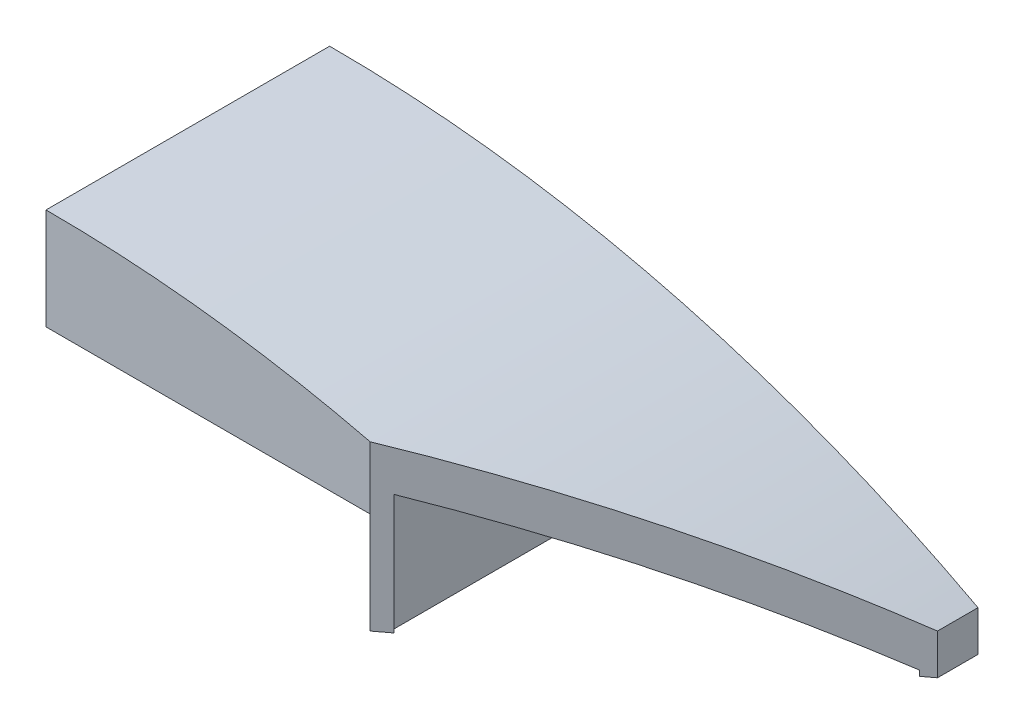
ISO-10303-21;
HEADER;
FILE_DESCRIPTION(('STEP AP214'),'2;1');
FILE_NAME('part.step','',(''),(''),'','','');
FILE_SCHEMA(('AUTOMOTIVE_DESIGN { 1 0 10303 214 1 1 1 1 }'));
ENDSEC;
DATA;
#1=APPLICATION_CONTEXT('core data for automotive mechanical design processes');
#2=APPLICATION_PROTOCOL_DEFINITION('international standard','automotive_design',2000,#1);
#3=PRODUCT_CONTEXT('',#1,'mechanical');
#4=PRODUCT('Part','Part','',(#3));
#5=PRODUCT_RELATED_PRODUCT_CATEGORY('part','',(#4));
#6=PRODUCT_DEFINITION_FORMATION('','',#4);
#7=PRODUCT_DEFINITION_CONTEXT('part definition',#1,'design');
#8=PRODUCT_DEFINITION('design','',#6,#7);
#9=PRODUCT_DEFINITION_SHAPE('','',#8);
#10=(LENGTH_UNIT() NAMED_UNIT(*) SI_UNIT(.MILLI.,.METRE.));
#11=(NAMED_UNIT(*) PLANE_ANGLE_UNIT() SI_UNIT($,.RADIAN.));
#12=(NAMED_UNIT(*) SI_UNIT($,.STERADIAN.) SOLID_ANGLE_UNIT());
#13=UNCERTAINTY_MEASURE_WITH_UNIT(LENGTH_MEASURE(1.E-05),#10,'distance_accuracy_value','');
#14=(GEOMETRIC_REPRESENTATION_CONTEXT(3) GLOBAL_UNCERTAINTY_ASSIGNED_CONTEXT((#13)) GLOBAL_UNIT_ASSIGNED_CONTEXT((#10,
#11,#12)) REPRESENTATION_CONTEXT('',''));
#15=CARTESIAN_POINT('',(0.,0.,0.));
#16=DIRECTION('',(0.,0.,1.));
#17=DIRECTION('',(1.,0.,0.));
#18=AXIS2_PLACEMENT_3D('',#15,#16,#17);
#19=CARTESIAN_POINT('',(-10.16,0.,4.445));
#20=DIRECTION('',(0.,1.,0.));
#21=DIRECTION('',(0.,0.,1.));
#22=AXIS2_PLACEMENT_3D('',#19,#20,#21);
#23=PLANE('',#22);
#24=DIRECTION('',(0.,0.,-1.));
#25=VECTOR('',#24,1.);
#26=CARTESIAN_POINT('',(0.,0.,4.445));
#27=LINE('',#26,#25);
#28=CARTESIAN_POINT('',(0.,0.,-4.1275));
#29=VERTEX_POINT('',#28);
#30=CARTESIAN_POINT('',(0.,0.,-4.445));
#31=VERTEX_POINT('',#30);
#32=EDGE_CURVE('E173',#29,#31,#27,.T.);
#33=ORIENTED_EDGE('',*,*,#32,.F.);
#34=DIRECTION('',(1.,0.,0.));
#35=VECTOR('',#34,1.);
#36=CARTESIAN_POINT('',(-9.8425,0.,-4.1275));
#37=LINE('',#36,#35);
#38=CARTESIAN_POINT('',(-9.8425,0.,-4.1275));
#39=VERTEX_POINT('',#38);
#40=EDGE_CURVE('E272',#39,#29,#37,.T.);
#41=ORIENTED_EDGE('',*,*,#40,.F.);
#42=DIRECTION('',(0.,0.,-1.));
#43=VECTOR('',#42,1.);
#44=CARTESIAN_POINT('',(-9.8425,0.,4.1275));
#45=LINE('',#44,#43);
#46=CARTESIAN_POINT('',(-9.8425,0.,4.1275));
#47=VERTEX_POINT('',#46);
#48=EDGE_CURVE('E269',#47,#39,#45,.T.);
#49=ORIENTED_EDGE('',*,*,#48,.F.);
#50=DIRECTION('',(-1.,0.,0.));
#51=VECTOR('',#50,1.);
#52=CARTESIAN_POINT('',(0.,0.,4.1275));
#53=LINE('',#52,#51);
#54=CARTESIAN_POINT('',(0.,0.,4.1275));
#55=VERTEX_POINT('',#54);
#56=EDGE_CURVE('E251',#55,#47,#53,.T.);
#57=ORIENTED_EDGE('',*,*,#56,.F.);
#58=CARTESIAN_POINT('',(0.,0.,4.445));
#59=VERTEX_POINT('',#58);
#60=EDGE_CURVE('E44',#59,#55,#27,.T.);
#61=ORIENTED_EDGE('',*,*,#60,.F.);
#62=DIRECTION('',(1.,0.,0.));
#63=VECTOR('',#62,1.);
#64=CARTESIAN_POINT('',(-10.16,0.,4.445));
#65=LINE('',#64,#63);
#66=CARTESIAN_POINT('',(-10.16,0.,4.445));
#67=VERTEX_POINT('',#66);
#68=EDGE_CURVE('E219',#67,#59,#65,.T.);
#69=ORIENTED_EDGE('',*,*,#68,.F.);
#70=DIRECTION('',(0.,0.,-1.));
#71=VECTOR('',#70,1.);
#72=CARTESIAN_POINT('',(-10.16,0.,4.445));
#73=LINE('',#72,#71);
#74=CARTESIAN_POINT('',(-10.16,0.,-4.445));
#75=VERTEX_POINT('',#74);
#76=EDGE_CURVE('E203',#67,#75,#73,.T.);
#77=ORIENTED_EDGE('',*,*,#76,.T.);
#78=DIRECTION('',(1.,0.,0.));
#79=VECTOR('',#78,1.);
#80=CARTESIAN_POINT('',(-10.16,0.,-4.445));
#81=LINE('',#80,#79);
#82=EDGE_CURVE('E198',#75,#31,#81,.T.);
#83=ORIENTED_EDGE('',*,*,#82,.T.);
#84=EDGE_LOOP('',(#33,#41,#49,#57,#61,#69,#77,#83));
#85=FACE_BOUND('',#84,.T.);
#86=ADVANCED_FACE('F37',(#85),#23,.F.);
#87=CARTESIAN_POINT('',(0.,0.,4.445));
#88=DIRECTION('',(1.,0.,0.));
#89=DIRECTION('',(0.,1.,0.));
#90=AXIS2_PLACEMENT_3D('',#87,#88,#89);
#91=PLANE('',#90);
#92=DIRECTION('',(0.,-1.,0.));
#93=VECTOR('',#92,1.);
#94=CARTESIAN_POINT('',(0.,0.,-4.445));
#95=LINE('',#94,#93);
#96=CARTESIAN_POINT('',(0.,-3.175,-4.445));
#97=VERTEX_POINT('',#96);
#98=EDGE_CURVE('E188',#31,#97,#95,.T.);
#99=ORIENTED_EDGE('',*,*,#98,.T.);
#100=DIRECTION('',(0.,0.,-1.));
#101=VECTOR('',#100,1.);
#102=CARTESIAN_POINT('',(0.,-3.175,4.445));
#103=LINE('',#102,#101);
#104=CARTESIAN_POINT('',(0.,-3.175,4.445));
#105=VERTEX_POINT('',#104);
#106=EDGE_CURVE('E171',#105,#97,#103,.T.);
#107=ORIENTED_EDGE('',*,*,#106,.F.);
#108=DIRECTION('',(0.,-1.,0.));
#109=VECTOR('',#108,1.);
#110=CARTESIAN_POINT('',(0.,0.,4.445));
#111=LINE('',#110,#109);
#112=EDGE_CURVE('E283',#59,#105,#111,.T.);
#113=ORIENTED_EDGE('',*,*,#112,.F.);
#114=ORIENTED_EDGE('',*,*,#60,.T.);
#115=DIRECTION('',(0.,-1.,0.));
#116=VECTOR('',#115,1.);
#117=CARTESIAN_POINT('',(0.,5.716,4.1275));
#118=LINE('',#117,#116);
#119=CARTESIAN_POINT('',(0.,0.654838907698595,4.1275));
#120=VERTEX_POINT('',#119);
#121=EDGE_CURVE('E274',#120,#55,#118,.T.);
#122=ORIENTED_EDGE('',*,*,#121,.F.);
#123=DIRECTION('',(0.,0.,-1.));
#124=VECTOR('',#123,1.);
#125=CARTESIAN_POINT('',(0.,0.654838907698595,4.445));
#126=LINE('',#125,#124);
#127=CARTESIAN_POINT('',(0.,0.654838907698595,-4.1275));
#128=VERTEX_POINT('',#127);
#129=EDGE_CURVE('E206',#120,#128,#126,.T.);
#130=ORIENTED_EDGE('',*,*,#129,.T.);
#131=DIRECTION('',(0.,-1.,0.));
#132=VECTOR('',#131,1.);
#133=CARTESIAN_POINT('',(0.,5.716,-4.1275));
#134=LINE('',#133,#132);
#135=EDGE_CURVE('E190',#128,#29,#134,.T.);
#136=ORIENTED_EDGE('',*,*,#135,.T.);
#137=ORIENTED_EDGE('',*,*,#32,.T.);
#138=EDGE_LOOP('',(#99,#107,#113,#114,#122,#130,#136,#137));
#139=FACE_BOUND('',#138,.T.);
#140=ADVANCED_FACE('F186',(#139),#91,.F.);
#141=CARTESIAN_POINT('',(0.,-3.175,4.445));
#142=DIRECTION('',(0.,1.,0.));
#143=DIRECTION('',(0.,0.,1.));
#144=AXIS2_PLACEMENT_3D('',#141,#142,#143);
#145=PLANE('',#144);
#146=DIRECTION('',(0.,0.,-1.));
#147=VECTOR('',#146,1.);
#148=CARTESIAN_POINT('',(10.16,-3.175,4.445));
#149=LINE('',#148,#147);
#150=CARTESIAN_POINT('',(10.16,-3.175,-3.175));
#151=VERTEX_POINT('',#150);
#152=CARTESIAN_POINT('',(10.16,-3.175,-4.445));
#153=VERTEX_POINT('',#152);
#154=EDGE_CURVE('E161',#151,#153,#149,.T.);
#155=ORIENTED_EDGE('',*,*,#154,.F.);
#156=DIRECTION('',(-0.8,0.,0.6));
#157=VECTOR('',#156,1.);
#158=CARTESIAN_POINT('',(10.16,-3.175,-3.175));
#159=LINE('',#158,#157);
#160=CARTESIAN_POINT('',(9.8425,-3.175,-2.936875));
#161=VERTEX_POINT('',#160);
#162=EDGE_CURVE('E144',#151,#161,#159,.T.);
#163=ORIENTED_EDGE('',*,*,#162,.T.);
#164=DIRECTION('',(0.,0.,1.));
#165=VECTOR('',#164,1.);
#166=CARTESIAN_POINT('',(9.8425,-3.175,4.1275));
#167=LINE('',#166,#165);
#168=CARTESIAN_POINT('',(9.8425,-3.175,-4.1275));
#169=VERTEX_POINT('',#168);
#170=EDGE_CURVE('E242',#169,#161,#167,.T.);
#171=ORIENTED_EDGE('',*,*,#170,.F.);
#172=DIRECTION('',(1.,0.,0.));
#173=VECTOR('',#172,1.);
#174=CARTESIAN_POINT('',(0.3175,-3.175,-4.1275));
#175=LINE('',#174,#173);
#176=CARTESIAN_POINT('',(0.3175,-3.175,-4.1275));
#177=VERTEX_POINT('',#176);
#178=EDGE_CURVE('E244',#177,#169,#175,.T.);
#179=ORIENTED_EDGE('',*,*,#178,.F.);
#180=DIRECTION('',(0.,0.,-1.));
#181=VECTOR('',#180,1.);
#182=CARTESIAN_POINT('',(0.3175,-3.175,4.1275));
#183=LINE('',#182,#181);
#184=CARTESIAN_POINT('',(0.3175,-3.175,4.1275));
#185=VERTEX_POINT('',#184);
#186=EDGE_CURVE('E58',#185,#177,#183,.T.);
#187=ORIENTED_EDGE('',*,*,#186,.F.);
#188=DIRECTION('',(-1.,0.,0.));
#189=VECTOR('',#188,1.);
#190=CARTESIAN_POINT('',(0.3175,-3.175,4.1275));
#191=LINE('',#190,#189);
#192=CARTESIAN_POINT('',(0.423333333333333,-3.175,4.1275));
#193=VERTEX_POINT('',#192);
#194=EDGE_CURVE('E239',#193,#185,#191,.T.);
#195=ORIENTED_EDGE('',*,*,#194,.F.);
#196=EDGE_CURVE('E155',#193,#105,#159,.T.);
#197=ORIENTED_EDGE('',*,*,#196,.T.);
#198=ORIENTED_EDGE('',*,*,#106,.T.);
#199=DIRECTION('',(1.,0.,0.));
#200=VECTOR('',#199,1.);
#201=CARTESIAN_POINT('',(0.,-3.175,-4.445));
#202=LINE('',#201,#200);
#203=EDGE_CURVE('E169',#97,#153,#202,.T.);
#204=ORIENTED_EDGE('',*,*,#203,.T.);
#205=EDGE_LOOP('',(#155,#163,#171,#179,#187,#195,#197,#198,#204));
#206=FACE_BOUND('',#205,.T.);
#207=ADVANCED_FACE('F166',(#206),#145,.F.);
#208=CARTESIAN_POINT('',(10.16,-3.175,4.445));
#209=DIRECTION('',(-1.,0.,0.));
#210=DIRECTION('',(0.,0.,1.));
#211=AXIS2_PLACEMENT_3D('',#208,#209,#210);
#212=PLANE('',#211);
#213=DIRECTION('',(0.,0.,-1.));
#214=VECTOR('',#213,1.);
#215=CARTESIAN_POINT('',(10.16,-1.905,4.445));
#216=LINE('',#215,#214);
#217=CARTESIAN_POINT('',(10.16,-1.905,-3.175));
#218=VERTEX_POINT('',#217);
#219=CARTESIAN_POINT('',(10.16,-1.905,-4.445));
#220=VERTEX_POINT('',#219);
#221=EDGE_CURVE('E163',#218,#220,#216,.T.);
#222=ORIENTED_EDGE('',*,*,#221,.F.);
#223=DIRECTION('',(0.,1.,0.));
#224=VECTOR('',#223,1.);
#225=CARTESIAN_POINT('',(10.16,-3.175,-3.175));
#226=LINE('',#225,#224);
#227=EDGE_CURVE('E147',#151,#218,#226,.T.);
#228=ORIENTED_EDGE('',*,*,#227,.F.);
#229=ORIENTED_EDGE('',*,*,#154,.T.);
#230=DIRECTION('',(0.,1.,0.));
#231=VECTOR('',#230,1.);
#232=CARTESIAN_POINT('',(10.16,-3.175,-4.445));
#233=LINE('',#232,#231);
#234=EDGE_CURVE('E213',#153,#220,#233,.T.);
#235=ORIENTED_EDGE('',*,*,#234,.T.);
#236=EDGE_LOOP('',(#222,#228,#229,#235));
#237=FACE_BOUND('',#236,.T.);
#238=ADVANCED_FACE('F159',(#237),#212,.F.);
#239=CARTESIAN_POINT('',(-10.16,-40.005,4.445));
#240=DIRECTION('',(0.,0.,-1.));
#241=DIRECTION('',(-1.,0.,0.));
#242=AXIS2_PLACEMENT_3D('',#239,#240,#241);
#243=CYLINDRICAL_SURFACE('',#242,43.18);
#244=CARTESIAN_POINT('',(-10.16,-40.005,4.445));
#245=DIRECTION('',(0.,0.,1.));
#246=DIRECTION('',(-1.,0.,0.));
#247=AXIS2_PLACEMENT_3D('',#244,#245,#246);
#248=CIRCLE('',#247,43.18);
#249=CARTESIAN_POINT('',(0.,1.9626875703201,4.445));
#250=VERTEX_POINT('',#249);
#251=CARTESIAN_POINT('',(-10.16,3.175,4.445));
#252=VERTEX_POINT('',#251);
#253=EDGE_CURVE('E230',#250,#252,#248,.T.);
#254=ORIENTED_EDGE('',*,*,#253,.F.);
#255=CARTESIAN_POINT('',(-10.16,-40.005,12.065));
#256=DIRECTION('',(-0.6,0.,-0.8));
#257=DIRECTION('',(0.8,0.,-0.6));
#258=AXIS2_PLACEMENT_3D('',#255,#256,#257);
#259=ELLIPSE('',#258,53.975,43.18);
#260=EDGE_CURVE('E229',#250,#218,#259,.T.);
#261=ORIENTED_EDGE('',*,*,#260,.T.);
#262=ORIENTED_EDGE('',*,*,#221,.T.);
#263=CARTESIAN_POINT('',(-10.16,-40.005,-4.445));
#264=DIRECTION('',(0.,0.,1.));
#265=DIRECTION('',(-1.,0.,0.));
#266=AXIS2_PLACEMENT_3D('',#263,#264,#265);
#267=CIRCLE('',#266,43.18);
#268=CARTESIAN_POINT('',(-10.16,3.175,-4.445));
#269=VERTEX_POINT('',#268);
#270=EDGE_CURVE('E215',#220,#269,#267,.T.);
#271=ORIENTED_EDGE('',*,*,#270,.T.);
#272=DIRECTION('',(0.,0.,-1.));
#273=VECTOR('',#272,1.);
#274=CARTESIAN_POINT('',(-10.16,3.175,4.445));
#275=LINE('',#274,#273);
#276=EDGE_CURVE('E175',#252,#269,#275,.T.);
#277=ORIENTED_EDGE('',*,*,#276,.F.);
#278=EDGE_LOOP('',(#254,#261,#262,#271,#277));
#279=FACE_BOUND('',#278,.T.);
#280=ADVANCED_FACE('F228',(#279),#243,.T.);
#281=CARTESIAN_POINT('',(-10.16,0.,4.445));
#282=DIRECTION('',(1.,0.,0.));
#283=DIRECTION('',(0.,0.,-1.));
#284=AXIS2_PLACEMENT_3D('',#281,#282,#283);
#285=PLANE('',#284);
#286=DIRECTION('',(0.,-1.,0.));
#287=VECTOR('',#286,1.);
#288=CARTESIAN_POINT('',(-10.16,0.,-4.445));
#289=LINE('',#288,#287);
#290=EDGE_CURVE('E217',#269,#75,#289,.T.);
#291=ORIENTED_EDGE('',*,*,#290,.T.);
#292=ORIENTED_EDGE('',*,*,#76,.F.);
#293=DIRECTION('',(0.,-1.,0.));
#294=VECTOR('',#293,1.);
#295=CARTESIAN_POINT('',(-10.16,0.,4.445));
#296=LINE('',#295,#294);
#297=EDGE_CURVE('E209',#252,#67,#296,.T.);
#298=ORIENTED_EDGE('',*,*,#297,.F.);
#299=ORIENTED_EDGE('',*,*,#276,.T.);
#300=EDGE_LOOP('',(#291,#292,#298,#299));
#301=FACE_BOUND('',#300,.T.);
#302=ADVANCED_FACE('F224',(#301),#285,.F.);
#303=CARTESIAN_POINT('',(-10.16,-40.005,4.445));
#304=DIRECTION('',(0.,0.,-1.));
#305=DIRECTION('',(-1.,0.,0.));
#306=AXIS2_PLACEMENT_3D('',#303,#304,#305);
#307=PLANE('',#306);
#308=ORIENTED_EDGE('',*,*,#68,.T.);
#309=DIRECTION('',(0.,1.,0.));
#310=VECTOR('',#309,1.);
#311=CARTESIAN_POINT('',(0.,-3.175,4.445));
#312=LINE('',#311,#310);
#313=EDGE_CURVE('E164',#59,#250,#312,.T.);
#314=ORIENTED_EDGE('',*,*,#313,.T.);
#315=ORIENTED_EDGE('',*,*,#253,.T.);
#316=ORIENTED_EDGE('',*,*,#297,.T.);
#317=EDGE_LOOP('',(#308,#314,#315,#316));
#318=FACE_BOUND('',#317,.T.);
#319=ADVANCED_FACE('F285',(#318),#307,.F.);
#320=CARTESIAN_POINT('',(-10.16,-40.005,-4.445));
#321=DIRECTION('',(0.,0.,-1.));
#322=DIRECTION('',(-1.,0.,0.));
#323=AXIS2_PLACEMENT_3D('',#320,#321,#322);
#324=PLANE('',#323);
#325=ORIENTED_EDGE('',*,*,#82,.F.);
#326=ORIENTED_EDGE('',*,*,#290,.F.);
#327=ORIENTED_EDGE('',*,*,#270,.F.);
#328=ORIENTED_EDGE('',*,*,#234,.F.);
#329=ORIENTED_EDGE('',*,*,#203,.F.);
#330=ORIENTED_EDGE('',*,*,#98,.F.);
#331=EDGE_LOOP('',(#325,#326,#327,#328,#329,#330));
#332=FACE_BOUND('',#331,.T.);
#333=ADVANCED_FACE('F196',(#332),#324,.T.);
#334=CARTESIAN_POINT('',(-9.8425,5.716,-4.1275));
#335=DIRECTION('',(0.,0.,-1.));
#336=DIRECTION('',(-1.,0.,0.));
#337=AXIS2_PLACEMENT_3D('',#334,#335,#336);
#338=PLANE('',#337);
#339=CARTESIAN_POINT('',(-10.16,-40.005,-4.1275));
#340=DIRECTION('',(0.,0.,-1.));
#341=DIRECTION('',(-1.,0.,0.));
#342=AXIS2_PLACEMENT_3D('',#339,#340,#341);
#343=CIRCLE('',#342,41.91);
#344=CARTESIAN_POINT('',(-9.8425,1.90379733122868,-4.1275));
#345=VERTEX_POINT('',#344);
#346=EDGE_CURVE('E264',#128,#345,#343,.F.);
#347=ORIENTED_EDGE('',*,*,#346,.T.);
#348=DIRECTION('',(0.,-1.,0.));
#349=VECTOR('',#348,1.);
#350=CARTESIAN_POINT('',(-9.8425,5.716,-4.1275));
#351=LINE('',#350,#349);
#352=EDGE_CURVE('E276',#345,#39,#351,.T.);
#353=ORIENTED_EDGE('',*,*,#352,.T.);
#354=ORIENTED_EDGE('',*,*,#40,.T.);
#355=ORIENTED_EDGE('',*,*,#135,.F.);
#356=EDGE_LOOP('',(#347,#353,#354,#355));
#357=FACE_BOUND('',#356,.T.);
#358=ADVANCED_FACE('F299',(#357),#338,.F.);
#359=CARTESIAN_POINT('',(-9.8425,5.716,4.1275));
#360=DIRECTION('',(-1.,0.,0.));
#361=DIRECTION('',(0.,0.,1.));
#362=AXIS2_PLACEMENT_3D('',#359,#360,#361);
#363=PLANE('',#362);
#364=DIRECTION('',(0.,0.,-1.));
#365=VECTOR('',#364,1.);
#366=CARTESIAN_POINT('',(-9.8425,1.90379733122868,4.445));
#367=LINE('',#366,#365);
#368=CARTESIAN_POINT('',(-9.8425,1.90379733122868,4.1275));
#369=VERTEX_POINT('',#368);
#370=EDGE_CURVE('E262',#345,#369,#367,.F.);
#371=ORIENTED_EDGE('',*,*,#370,.T.);
#372=DIRECTION('',(0.,-1.,0.));
#373=VECTOR('',#372,1.);
#374=CARTESIAN_POINT('',(-9.8425,5.716,4.1275));
#375=LINE('',#374,#373);
#376=EDGE_CURVE('E278',#369,#47,#375,.T.);
#377=ORIENTED_EDGE('',*,*,#376,.T.);
#378=ORIENTED_EDGE('',*,*,#48,.T.);
#379=ORIENTED_EDGE('',*,*,#352,.F.);
#380=EDGE_LOOP('',(#371,#377,#378,#379));
#381=FACE_BOUND('',#380,.T.);
#382=ADVANCED_FACE('F301',(#381),#363,.F.);
#383=CARTESIAN_POINT('',(0.,5.716,4.1275));
#384=DIRECTION('',(0.,0.,1.));
#385=DIRECTION('',(1.,0.,0.));
#386=AXIS2_PLACEMENT_3D('',#383,#384,#385);
#387=PLANE('',#386);
#388=CARTESIAN_POINT('',(-10.16,-40.005,4.1275));
#389=DIRECTION('',(0.,0.,1.));
#390=DIRECTION('',(1.,0.,0.));
#391=AXIS2_PLACEMENT_3D('',#388,#389,#390);
#392=CIRCLE('',#391,41.91);
#393=EDGE_CURVE('E204',#369,#120,#392,.F.);
#394=ORIENTED_EDGE('',*,*,#393,.T.);
#395=ORIENTED_EDGE('',*,*,#121,.T.);
#396=ORIENTED_EDGE('',*,*,#56,.T.);
#397=ORIENTED_EDGE('',*,*,#376,.F.);
#398=EDGE_LOOP('',(#394,#395,#396,#397));
#399=FACE_BOUND('',#398,.T.);
#400=ADVANCED_FACE('F290',(#399),#387,.F.);
#401=CARTESIAN_POINT('',(-10.16,-40.005,4.445));
#402=DIRECTION('',(0.,0.,-1.));
#403=DIRECTION('',(-1.,0.,0.));
#404=AXIS2_PLACEMENT_3D('',#401,#402,#403);
#405=CYLINDRICAL_SURFACE('',#404,41.91);
#406=ORIENTED_EDGE('',*,*,#129,.F.);
#407=ORIENTED_EDGE('',*,*,#393,.F.);
#408=ORIENTED_EDGE('',*,*,#370,.F.);
#409=ORIENTED_EDGE('',*,*,#346,.F.);
#410=EDGE_LOOP('',(#406,#407,#408,#409));
#411=FACE_BOUND('',#410,.T.);
#412=ADVANCED_FACE('F296',(#411),#405,.F.);
#413=CARTESIAN_POINT('',(0.3175,5.716,4.1275));
#414=DIRECTION('',(-1.,0.,0.));
#415=DIRECTION('',(0.,0.,1.));
#416=AXIS2_PLACEMENT_3D('',#413,#414,#415);
#417=PLANE('',#416);
#418=DIRECTION('',(0.,0.,-1.));
#419=VECTOR('',#418,1.);
#420=CARTESIAN_POINT('',(0.3175,0.614549934918142,4.445));
#421=LINE('',#420,#419);
#422=CARTESIAN_POINT('',(0.3175,0.614549934918142,-4.1275));
#423=VERTEX_POINT('',#422);
#424=CARTESIAN_POINT('',(0.3175,0.614549934918142,4.1275));
#425=VERTEX_POINT('',#424);
#426=EDGE_CURVE('E255',#423,#425,#421,.F.);
#427=ORIENTED_EDGE('',*,*,#426,.T.);
#428=DIRECTION('',(0.,-1.,0.));
#429=VECTOR('',#428,1.);
#430=CARTESIAN_POINT('',(0.3175,5.716,4.1275));
#431=LINE('',#430,#429);
#432=EDGE_CURVE('E234',#425,#185,#431,.T.);
#433=ORIENTED_EDGE('',*,*,#432,.T.);
#434=ORIENTED_EDGE('',*,*,#186,.T.);
#435=DIRECTION('',(0.,-1.,0.));
#436=VECTOR('',#435,1.);
#437=CARTESIAN_POINT('',(0.3175,5.716,-4.1275));
#438=LINE('',#437,#436);
#439=EDGE_CURVE('E232',#423,#177,#438,.T.);
#440=ORIENTED_EDGE('',*,*,#439,.F.);
#441=EDGE_LOOP('',(#427,#433,#434,#440));
#442=FACE_BOUND('',#441,.T.);
#443=ADVANCED_FACE('F341',(#442),#417,.F.);
#444=CARTESIAN_POINT('',(0.3175,5.716,4.1275));
#445=DIRECTION('',(0.,0.,1.));
#446=DIRECTION('',(1.,0.,0.));
#447=AXIS2_PLACEMENT_3D('',#444,#445,#446);
#448=PLANE('',#447);
#449=CARTESIAN_POINT('',(-10.16,-41.275,4.1275));
#450=DIRECTION('',(0.,0.,1.));
#451=DIRECTION('',(1.,0.,0.));
#452=AXIS2_PLACEMENT_3D('',#449,#450,#451);
#453=CIRCLE('',#452,43.18);
#454=CARTESIAN_POINT('',(0.423333333333331,0.587936537652919,4.1275));
#455=VERTEX_POINT('',#454);
#456=EDGE_CURVE('E252',#425,#455,#453,.F.);
#457=ORIENTED_EDGE('',*,*,#456,.T.);
#458=DIRECTION('',(0.,-1.,0.));
#459=VECTOR('',#458,1.);
#460=CARTESIAN_POINT('',(0.423333333333334,5.716,4.1275));
#461=LINE('',#460,#459);
#462=EDGE_CURVE('E50',#455,#193,#461,.T.);
#463=ORIENTED_EDGE('',*,*,#462,.T.);
#464=ORIENTED_EDGE('',*,*,#194,.T.);
#465=ORIENTED_EDGE('',*,*,#432,.F.);
#466=EDGE_LOOP('',(#457,#463,#464,#465));
#467=FACE_BOUND('',#466,.T.);
#468=ADVANCED_FACE('F336',(#467),#448,.F.);
#469=CARTESIAN_POINT('',(9.8425,5.716,4.1275));
#470=DIRECTION('',(1.,0.,0.));
#471=DIRECTION('',(0.,0.,-1.));
#472=AXIS2_PLACEMENT_3D('',#469,#470,#471);
#473=PLANE('',#472);
#474=ORIENTED_EDGE('',*,*,#170,.T.);
#475=DIRECTION('',(0.,1.,0.));
#476=VECTOR('',#475,1.);
#477=CARTESIAN_POINT('',(9.8425,5.716,-2.936875));
#478=LINE('',#477,#476);
#479=CARTESIAN_POINT('',(9.8425,-3.00735839838049,-2.936875));
#480=VERTEX_POINT('',#479);
#481=EDGE_CURVE('E150',#161,#480,#478,.T.);
#482=ORIENTED_EDGE('',*,*,#481,.T.);
#483=DIRECTION('',(0.,0.,-1.));
#484=VECTOR('',#483,1.);
#485=CARTESIAN_POINT('',(9.8425,-3.00735839838049,4.445));
#486=LINE('',#485,#484);
#487=CARTESIAN_POINT('',(9.8425,-3.00735839838049,-4.1275));
#488=VERTEX_POINT('',#487);
#489=EDGE_CURVE('E249',#480,#488,#486,.T.);
#490=ORIENTED_EDGE('',*,*,#489,.T.);
#491=DIRECTION('',(0.,-1.,0.));
#492=VECTOR('',#491,1.);
#493=CARTESIAN_POINT('',(9.8425,5.716,-4.1275));
#494=LINE('',#493,#492);
#495=EDGE_CURVE('E248',#488,#169,#494,.T.);
#496=ORIENTED_EDGE('',*,*,#495,.T.);
#497=EDGE_LOOP('',(#474,#482,#490,#496));
#498=FACE_BOUND('',#497,.T.);
#499=ADVANCED_FACE('F340',(#498),#473,.F.);
#500=CARTESIAN_POINT('',(0.3175,5.716,-4.1275));
#501=DIRECTION('',(0.,0.,-1.));
#502=DIRECTION('',(-1.,0.,0.));
#503=AXIS2_PLACEMENT_3D('',#500,#501,#502);
#504=PLANE('',#503);
#505=CARTESIAN_POINT('',(-10.16,-41.275,-4.1275));
#506=DIRECTION('',(0.,0.,-1.));
#507=DIRECTION('',(-1.,0.,0.));
#508=AXIS2_PLACEMENT_3D('',#505,#506,#507);
#509=CIRCLE('',#508,43.18);
#510=EDGE_CURVE('E241',#488,#423,#509,.F.);
#511=ORIENTED_EDGE('',*,*,#510,.T.);
#512=ORIENTED_EDGE('',*,*,#439,.T.);
#513=ORIENTED_EDGE('',*,*,#178,.T.);
#514=ORIENTED_EDGE('',*,*,#495,.F.);
#515=EDGE_LOOP('',(#511,#512,#513,#514));
#516=FACE_BOUND('',#515,.T.);
#517=ADVANCED_FACE('F350',(#516),#504,.F.);
#518=CARTESIAN_POINT('',(-10.16,-41.275,4.445));
#519=DIRECTION('',(0.,0.,-1.));
#520=DIRECTION('',(-1.,0.,0.));
#521=AXIS2_PLACEMENT_3D('',#518,#519,#520);
#522=CYLINDRICAL_SURFACE('',#521,43.18);
#523=CARTESIAN_POINT('',(-10.16,-41.275,12.065));
#524=DIRECTION('',(-0.6,0.,-0.8));
#525=DIRECTION('',(0.8,0.,-0.6));
#526=AXIS2_PLACEMENT_3D('',#523,#524,#525);
#527=ELLIPSE('',#526,53.975,43.18);
#528=EDGE_CURVE('E12',#455,#480,#527,.T.);
#529=ORIENTED_EDGE('',*,*,#528,.F.);
#530=ORIENTED_EDGE('',*,*,#456,.F.);
#531=ORIENTED_EDGE('',*,*,#426,.F.);
#532=ORIENTED_EDGE('',*,*,#510,.F.);
#533=ORIENTED_EDGE('',*,*,#489,.F.);
#534=EDGE_LOOP('',(#529,#530,#531,#532,#533));
#535=FACE_BOUND('',#534,.T.);
#536=ADVANCED_FACE('F356',(#535),#522,.F.);
#537=CARTESIAN_POINT('',(10.16,-3.175,-3.175));
#538=DIRECTION('',(-0.6,0.,-0.8));
#539=DIRECTION('',(-0.8,0.,0.6));
#540=AXIS2_PLACEMENT_3D('',#537,#538,#539);
#541=PLANE('',#540);
#542=ORIENTED_EDGE('',*,*,#313,.F.);
#543=ORIENTED_EDGE('',*,*,#112,.T.);
#544=ORIENTED_EDGE('',*,*,#196,.F.);
#545=ORIENTED_EDGE('',*,*,#462,.F.);
#546=ORIENTED_EDGE('',*,*,#528,.T.);
#547=ORIENTED_EDGE('',*,*,#481,.F.);
#548=ORIENTED_EDGE('',*,*,#162,.F.);
#549=ORIENTED_EDGE('',*,*,#227,.T.);
#550=ORIENTED_EDGE('',*,*,#260,.F.);
#551=EDGE_LOOP('',(#542,#543,#544,#545,#546,#547,#548,#549,#550));
#552=FACE_BOUND('',#551,.T.);
#553=ADVANCED_FACE('F146',(#552),#541,.F.);
#554=CLOSED_SHELL('',(#86,#140,#207,#238,#280,#302,#319,#333,#358,#382,#400,#412,#443,#468,#499,
#517,#536,#553));
#555=MANIFOLD_SOLID_BREP('B2',#554);
#556=ADVANCED_BREP_SHAPE_REPRESENTATION('',(#18,#555),#14);
#557=SHAPE_DEFINITION_REPRESENTATION(#9,#556);
ENDSEC;
END-ISO-10303-21;
